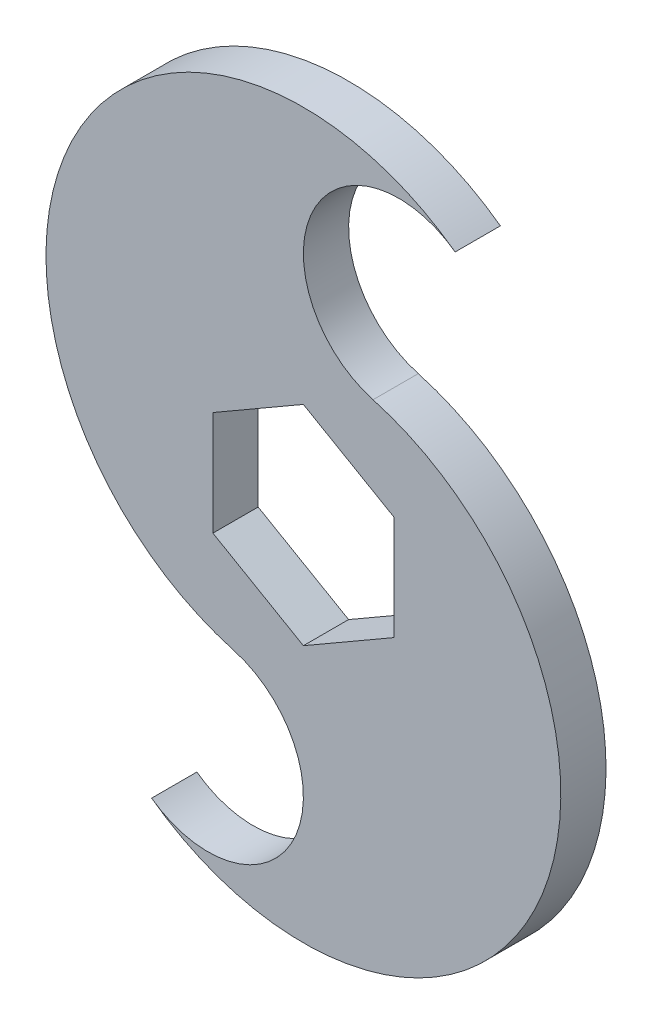
ISO-10303-21;
HEADER;
FILE_DESCRIPTION(('STEP AP214'),'2;1');
FILE_NAME('part.step','',(''),(''),'','','');
FILE_SCHEMA(('AUTOMOTIVE_DESIGN { 1 0 10303 214 1 1 1 1 }'));
ENDSEC;
DATA;
#1=APPLICATION_CONTEXT('core data for automotive mechanical design processes');
#2=APPLICATION_PROTOCOL_DEFINITION('international standard','automotive_design',2000,#1);
#3=PRODUCT_CONTEXT('',#1,'mechanical');
#4=PRODUCT('Part','Part','',(#3));
#5=PRODUCT_RELATED_PRODUCT_CATEGORY('part','',(#4));
#6=PRODUCT_DEFINITION_FORMATION('','',#4);
#7=PRODUCT_DEFINITION_CONTEXT('part definition',#1,'design');
#8=PRODUCT_DEFINITION('design','',#6,#7);
#9=PRODUCT_DEFINITION_SHAPE('','',#8);
#10=(LENGTH_UNIT() NAMED_UNIT(*) SI_UNIT(.MILLI.,.METRE.));
#11=(NAMED_UNIT(*) PLANE_ANGLE_UNIT() SI_UNIT($,.RADIAN.));
#12=(NAMED_UNIT(*) SI_UNIT($,.STERADIAN.) SOLID_ANGLE_UNIT());
#13=UNCERTAINTY_MEASURE_WITH_UNIT(LENGTH_MEASURE(1.E-05),#10,'distance_accuracy_value','');
#14=(GEOMETRIC_REPRESENTATION_CONTEXT(3) GLOBAL_UNCERTAINTY_ASSIGNED_CONTEXT((#13)) GLOBAL_UNIT_ASSIGNED_CONTEXT((#10,
#11,#12)) REPRESENTATION_CONTEXT('',''));
#15=CARTESIAN_POINT('',(0.,0.,0.));
#16=DIRECTION('',(0.,0.,1.));
#17=DIRECTION('',(1.,0.,0.));
#18=AXIS2_PLACEMENT_3D('',#15,#16,#17);
#19=CARTESIAN_POINT('',(6.70139784377673,9.18057683182266,3.175));
#20=DIRECTION('',(0.,0.,1.));
#21=DIRECTION('',(1.,0.,0.));
#22=AXIS2_PLACEMENT_3D('',#19,#20,#21);
#23=PLANE('',#22);
#24=CARTESIAN_POINT('',(13.4027956875535,33.0258505010618,3.175));
#25=DIRECTION('',(0.,0.,-1.));
#26=DIRECTION('',(1.,0.,0.));
#27=AXIS2_PLACEMENT_3D('',#24,#25,#26);
#28=CIRCLE('',#27,13.4027956875535);
#29=CARTESIAN_POINT('',(9.77659814642989,20.1229196853498,3.175));
#30=VERTEX_POINT('',#29);
#31=CARTESIAN_POINT('',(21.3049126203035,43.8513518854526,3.175));
#32=VERTEX_POINT('',#31);
#33=EDGE_CURVE('E161',#30,#32,#28,.T.);
#34=ORIENTED_EDGE('',*,*,#33,.T.);
#35=CARTESIAN_POINT('',(0.,14.6646968374165,3.175));
#36=DIRECTION('',(0.,0.,1.));
#37=DIRECTION('',(1.,0.,0.));
#38=AXIS2_PLACEMENT_3D('',#35,#36,#37);
#39=CIRCLE('',#38,36.1353031625835);
#40=CARTESIAN_POINT('',(-9.77659814642991,-20.1229196853498,3.175));
#41=VERTEX_POINT('',#40);
#42=EDGE_CURVE('E164',#32,#41,#39,.T.);
#43=ORIENTED_EDGE('',*,*,#42,.T.);
#44=CARTESIAN_POINT('',(-13.4027956875535,-33.0258505010618,3.175));
#45=DIRECTION('',(0.,0.,-1.));
#46=DIRECTION('',(-1.,0.,0.));
#47=AXIS2_PLACEMENT_3D('',#44,#45,#46);
#48=CIRCLE('',#47,13.4027956875534);
#49=CARTESIAN_POINT('',(-21.3049126203035,-43.8513518854526,3.175));
#50=VERTEX_POINT('',#49);
#51=EDGE_CURVE('E167',#41,#50,#48,.T.);
#52=ORIENTED_EDGE('',*,*,#51,.T.);
#53=CARTESIAN_POINT('',(0.,-14.6646968374165,3.175));
#54=DIRECTION('',(0.,0.,1.));
#55=DIRECTION('',(1.,0.,0.));
#56=AXIS2_PLACEMENT_3D('',#53,#54,#55);
#57=CIRCLE('',#56,36.1353031625835);
#58=EDGE_CURVE('E169',#50,#30,#57,.T.);
#59=ORIENTED_EDGE('',*,*,#58,.T.);
#60=EDGE_LOOP('',(#34,#43,#52,#59));
#61=FACE_BOUND('',#60,.T.);
#62=DIRECTION('',(-0.866025403784439,-0.499999999999999,0.));
#63=VECTOR('',#62,1.);
#64=CARTESIAN_POINT('',(0.,14.6646968374165,3.175));
#65=LINE('',#64,#63);
#66=CARTESIAN_POINT('',(0.,14.6646968374165,3.175));
#67=VERTEX_POINT('',#66);
#68=CARTESIAN_POINT('',(-12.7,7.33234841870826,3.175));
#69=VERTEX_POINT('',#68);
#70=EDGE_CURVE('E118',#67,#69,#65,.T.);
#71=ORIENTED_EDGE('',*,*,#70,.F.);
#72=DIRECTION('',(-0.866025403784439,0.5,0.));
#73=VECTOR('',#72,1.);
#74=CARTESIAN_POINT('',(12.7,7.33234841870824,3.175));
#75=LINE('',#74,#73);
#76=CARTESIAN_POINT('',(12.7,7.33234841870824,3.175));
#77=VERTEX_POINT('',#76);
#78=EDGE_CURVE('E110',#77,#67,#75,.T.);
#79=ORIENTED_EDGE('',*,*,#78,.F.);
#80=DIRECTION('',(0.,1.,0.));
#81=VECTOR('',#80,1.);
#82=CARTESIAN_POINT('',(12.7,-7.33234841870826,3.175));
#83=LINE('',#82,#81);
#84=CARTESIAN_POINT('',(12.7,-7.33234841870825,3.175));
#85=VERTEX_POINT('',#84);
#86=EDGE_CURVE('E139',#85,#77,#83,.T.);
#87=ORIENTED_EDGE('',*,*,#86,.F.);
#88=DIRECTION('',(0.866025403784439,0.5,0.));
#89=VECTOR('',#88,1.);
#90=CARTESIAN_POINT('',(0.,-14.6646968374165,3.175));
#91=LINE('',#90,#89);
#92=CARTESIAN_POINT('',(0.,-14.6646968374165,3.175));
#93=VERTEX_POINT('',#92);
#94=EDGE_CURVE('E137',#93,#85,#91,.T.);
#95=ORIENTED_EDGE('',*,*,#94,.F.);
#96=DIRECTION('',(0.866025403784439,-0.5,0.));
#97=VECTOR('',#96,1.);
#98=CARTESIAN_POINT('',(-12.7,-7.33234841870825,3.175));
#99=LINE('',#98,#97);
#100=CARTESIAN_POINT('',(-12.7,-7.33234841870825,3.175));
#101=VERTEX_POINT('',#100);
#102=EDGE_CURVE('E133',#101,#93,#99,.T.);
#103=ORIENTED_EDGE('',*,*,#102,.F.);
#104=DIRECTION('',(0.,-1.,0.));
#105=VECTOR('',#104,1.);
#106=CARTESIAN_POINT('',(-12.7,7.33234841870826,3.175));
#107=LINE('',#106,#105);
#108=EDGE_CURVE('E131',#69,#101,#107,.T.);
#109=ORIENTED_EDGE('',*,*,#108,.F.);
#110=EDGE_LOOP('',(#71,#79,#87,#95,#103,#109));
#111=FACE_BOUND('',#110,.T.);
#112=ADVANCED_FACE('F33',(#61,#111),#23,.T.);
#113=CARTESIAN_POINT('',(6.70139784377673,9.18057683182266,-3.175));
#114=DIRECTION('',(0.,0.,1.));
#115=DIRECTION('',(1.,0.,0.));
#116=AXIS2_PLACEMENT_3D('',#113,#114,#115);
#117=PLANE('',#116);
#118=CARTESIAN_POINT('',(13.4027956875535,33.0258505010618,-3.175));
#119=DIRECTION('',(0.,0.,-1.));
#120=DIRECTION('',(1.,0.,0.));
#121=AXIS2_PLACEMENT_3D('',#118,#119,#120);
#122=CIRCLE('',#121,13.4027956875535);
#123=CARTESIAN_POINT('',(9.77659814642989,20.1229196853498,-3.175));
#124=VERTEX_POINT('',#123);
#125=CARTESIAN_POINT('',(21.3049126203035,43.8513518854526,-3.175));
#126=VERTEX_POINT('',#125);
#127=EDGE_CURVE('E126',#124,#126,#122,.T.);
#128=ORIENTED_EDGE('',*,*,#127,.F.);
#129=CARTESIAN_POINT('',(0.,-14.6646968374165,-3.175));
#130=DIRECTION('',(0.,0.,1.));
#131=DIRECTION('',(1.,0.,0.));
#132=AXIS2_PLACEMENT_3D('',#129,#130,#131);
#133=CIRCLE('',#132,36.1353031625835);
#134=CARTESIAN_POINT('',(-21.3049126203035,-43.8513518854526,-3.175));
#135=VERTEX_POINT('',#134);
#136=EDGE_CURVE('E165',#135,#124,#133,.T.);
#137=ORIENTED_EDGE('',*,*,#136,.F.);
#138=CARTESIAN_POINT('',(-13.4027956875535,-33.0258505010618,-3.175));
#139=DIRECTION('',(0.,0.,-1.));
#140=DIRECTION('',(-1.,0.,0.));
#141=AXIS2_PLACEMENT_3D('',#138,#139,#140);
#142=CIRCLE('',#141,13.4027956875534);
#143=CARTESIAN_POINT('',(-9.77659814642991,-20.1229196853498,-3.175));
#144=VERTEX_POINT('',#143);
#145=EDGE_CURVE('E176',#144,#135,#142,.T.);
#146=ORIENTED_EDGE('',*,*,#145,.F.);
#147=CARTESIAN_POINT('',(0.,14.6646968374165,-3.175));
#148=DIRECTION('',(0.,0.,1.));
#149=DIRECTION('',(1.,0.,0.));
#150=AXIS2_PLACEMENT_3D('',#147,#148,#149);
#151=CIRCLE('',#150,36.1353031625835);
#152=EDGE_CURVE('E174',#126,#144,#151,.T.);
#153=ORIENTED_EDGE('',*,*,#152,.F.);
#154=EDGE_LOOP('',(#128,#137,#146,#153));
#155=FACE_BOUND('',#154,.T.);
#156=DIRECTION('',(-0.866025403784439,0.5,0.));
#157=VECTOR('',#156,1.);
#158=CARTESIAN_POINT('',(12.7,7.33234841870824,-3.175));
#159=LINE('',#158,#157);
#160=CARTESIAN_POINT('',(12.7,7.33234841870824,-3.175));
#161=VERTEX_POINT('',#160);
#162=CARTESIAN_POINT('',(0.,14.6646968374165,-3.175));
#163=VERTEX_POINT('',#162);
#164=EDGE_CURVE('E56',#161,#163,#159,.T.);
#165=ORIENTED_EDGE('',*,*,#164,.T.);
#166=DIRECTION('',(-0.866025403784439,-0.499999999999999,0.));
#167=VECTOR('',#166,1.);
#168=CARTESIAN_POINT('',(0.,14.6646968374165,-3.175));
#169=LINE('',#168,#167);
#170=CARTESIAN_POINT('',(-12.7,7.33234841870826,-3.175));
#171=VERTEX_POINT('',#170);
#172=EDGE_CURVE('E125',#163,#171,#169,.T.);
#173=ORIENTED_EDGE('',*,*,#172,.T.);
#174=DIRECTION('',(0.,-1.,0.));
#175=VECTOR('',#174,1.);
#176=CARTESIAN_POINT('',(-12.7,7.33234841870826,-3.175));
#177=LINE('',#176,#175);
#178=CARTESIAN_POINT('',(-12.7,-7.33234841870825,-3.175));
#179=VERTEX_POINT('',#178);
#180=EDGE_CURVE('E143',#171,#179,#177,.T.);
#181=ORIENTED_EDGE('',*,*,#180,.T.);
#182=DIRECTION('',(0.866025403784439,-0.5,0.));
#183=VECTOR('',#182,1.);
#184=CARTESIAN_POINT('',(-12.7,-7.33234841870825,-3.175));
#185=LINE('',#184,#183);
#186=CARTESIAN_POINT('',(0.,-14.6646968374165,-3.175));
#187=VERTEX_POINT('',#186);
#188=EDGE_CURVE('E146',#179,#187,#185,.T.);
#189=ORIENTED_EDGE('',*,*,#188,.T.);
#190=DIRECTION('',(0.866025403784439,0.5,0.));
#191=VECTOR('',#190,1.);
#192=CARTESIAN_POINT('',(0.,-14.6646968374165,-3.175));
#193=LINE('',#192,#191);
#194=CARTESIAN_POINT('',(12.7,-7.33234841870826,-3.175));
#195=VERTEX_POINT('',#194);
#196=EDGE_CURVE('E149',#187,#195,#193,.T.);
#197=ORIENTED_EDGE('',*,*,#196,.T.);
#198=DIRECTION('',(0.,1.,0.));
#199=VECTOR('',#198,1.);
#200=CARTESIAN_POINT('',(12.7,-7.33234841870826,-3.175));
#201=LINE('',#200,#199);
#202=EDGE_CURVE('E119',#195,#161,#201,.T.);
#203=ORIENTED_EDGE('',*,*,#202,.T.);
#204=EDGE_LOOP('',(#165,#173,#181,#189,#197,#203));
#205=FACE_BOUND('',#204,.T.);
#206=ADVANCED_FACE('F194',(#155,#205),#117,.F.);
#207=CARTESIAN_POINT('',(13.4027956875535,33.0258505010618,3.175));
#208=DIRECTION('',(0.,0.,-1.));
#209=DIRECTION('',(-1.,0.,0.));
#210=AXIS2_PLACEMENT_3D('',#207,#208,#209);
#211=CYLINDRICAL_SURFACE('',#210,13.4027956875535);
#212=ORIENTED_EDGE('',*,*,#127,.T.);
#213=DIRECTION('',(0.,0.,-1.));
#214=VECTOR('',#213,1.);
#215=CARTESIAN_POINT('',(21.3049126203035,43.8513518854526,3.175));
#216=LINE('',#215,#214);
#217=EDGE_CURVE('E11',#32,#126,#216,.T.);
#218=ORIENTED_EDGE('',*,*,#217,.F.);
#219=ORIENTED_EDGE('',*,*,#33,.F.);
#220=DIRECTION('',(0.,0.,-1.));
#221=VECTOR('',#220,1.);
#222=CARTESIAN_POINT('',(9.77659814642989,20.1229196853498,3.175));
#223=LINE('',#222,#221);
#224=EDGE_CURVE('E171',#30,#124,#223,.T.);
#225=ORIENTED_EDGE('',*,*,#224,.T.);
#226=EDGE_LOOP('',(#212,#218,#219,#225));
#227=FACE_BOUND('',#226,.T.);
#228=ADVANCED_FACE('F35',(#227),#211,.F.);
#229=CARTESIAN_POINT('',(0.,14.6646968374165,3.175));
#230=DIRECTION('',(0.,0.,-1.));
#231=DIRECTION('',(-1.,0.,0.));
#232=AXIS2_PLACEMENT_3D('',#229,#230,#231);
#233=CYLINDRICAL_SURFACE('',#232,36.1353031625835);
#234=ORIENTED_EDGE('',*,*,#152,.T.);
#235=DIRECTION('',(0.,0.,-1.));
#236=VECTOR('',#235,1.);
#237=CARTESIAN_POINT('',(-9.77659814642991,-20.1229196853498,3.175));
#238=LINE('',#237,#236);
#239=EDGE_CURVE('E41',#41,#144,#238,.T.);
#240=ORIENTED_EDGE('',*,*,#239,.F.);
#241=ORIENTED_EDGE('',*,*,#42,.F.);
#242=ORIENTED_EDGE('',*,*,#217,.T.);
#243=EDGE_LOOP('',(#234,#240,#241,#242));
#244=FACE_BOUND('',#243,.T.);
#245=ADVANCED_FACE('F204',(#244),#233,.T.);
#246=CARTESIAN_POINT('',(-13.4027956875535,-33.0258505010618,3.175));
#247=DIRECTION('',(0.,0.,-1.));
#248=DIRECTION('',(-1.,0.,0.));
#249=AXIS2_PLACEMENT_3D('',#246,#247,#248);
#250=CYLINDRICAL_SURFACE('',#249,13.4027956875534);
#251=ORIENTED_EDGE('',*,*,#145,.T.);
#252=DIRECTION('',(0.,0.,-1.));
#253=VECTOR('',#252,1.);
#254=CARTESIAN_POINT('',(-21.3049126203035,-43.8513518854526,3.175));
#255=LINE('',#254,#253);
#256=EDGE_CURVE('E181',#50,#135,#255,.T.);
#257=ORIENTED_EDGE('',*,*,#256,.F.);
#258=ORIENTED_EDGE('',*,*,#51,.F.);
#259=ORIENTED_EDGE('',*,*,#239,.T.);
#260=EDGE_LOOP('',(#251,#257,#258,#259));
#261=FACE_BOUND('',#260,.T.);
#262=ADVANCED_FACE('F188',(#261),#250,.F.);
#263=CARTESIAN_POINT('',(0.,-14.6646968374165,3.175));
#264=DIRECTION('',(0.,0.,-1.));
#265=DIRECTION('',(-1.,0.,0.));
#266=AXIS2_PLACEMENT_3D('',#263,#264,#265);
#267=CYLINDRICAL_SURFACE('',#266,36.1353031625835);
#268=ORIENTED_EDGE('',*,*,#136,.T.);
#269=ORIENTED_EDGE('',*,*,#224,.F.);
#270=ORIENTED_EDGE('',*,*,#58,.F.);
#271=ORIENTED_EDGE('',*,*,#256,.T.);
#272=EDGE_LOOP('',(#268,#269,#270,#271));
#273=FACE_BOUND('',#272,.T.);
#274=ADVANCED_FACE('F198',(#273),#267,.T.);
#275=CARTESIAN_POINT('',(12.7,7.33234841870824,3.175));
#276=DIRECTION('',(-0.5,-0.866025403784439,0.));
#277=DIRECTION('',(0.866025403784439,-0.5,0.));
#278=AXIS2_PLACEMENT_3D('',#275,#276,#277);
#279=PLANE('',#278);
#280=ORIENTED_EDGE('',*,*,#164,.F.);
#281=DIRECTION('',(0.,0.,-1.));
#282=VECTOR('',#281,1.);
#283=CARTESIAN_POINT('',(12.7,7.33234841870824,3.175));
#284=LINE('',#283,#282);
#285=EDGE_CURVE('E114',#77,#161,#284,.T.);
#286=ORIENTED_EDGE('',*,*,#285,.F.);
#287=ORIENTED_EDGE('',*,*,#78,.T.);
#288=DIRECTION('',(0.,0.,-1.));
#289=VECTOR('',#288,1.);
#290=CARTESIAN_POINT('',(0.,14.6646968374165,3.175));
#291=LINE('',#290,#289);
#292=EDGE_CURVE('E113',#67,#163,#291,.T.);
#293=ORIENTED_EDGE('',*,*,#292,.T.);
#294=EDGE_LOOP('',(#280,#286,#287,#293));
#295=FACE_BOUND('',#294,.T.);
#296=ADVANCED_FACE('F112',(#295),#279,.T.);
#297=CARTESIAN_POINT('',(0.,14.6646968374165,3.175));
#298=DIRECTION('',(0.499999999999999,-0.866025403784439,0.));
#299=DIRECTION('',(0.866025403784439,0.5,0.));
#300=AXIS2_PLACEMENT_3D('',#297,#298,#299);
#301=PLANE('',#300);
#302=ORIENTED_EDGE('',*,*,#172,.F.);
#303=ORIENTED_EDGE('',*,*,#292,.F.);
#304=ORIENTED_EDGE('',*,*,#70,.T.);
#305=DIRECTION('',(0.,0.,-1.));
#306=VECTOR('',#305,1.);
#307=CARTESIAN_POINT('',(-12.7,7.33234841870826,3.175));
#308=LINE('',#307,#306);
#309=EDGE_CURVE('E127',#69,#171,#308,.T.);
#310=ORIENTED_EDGE('',*,*,#309,.T.);
#311=EDGE_LOOP('',(#302,#303,#304,#310));
#312=FACE_BOUND('',#311,.T.);
#313=ADVANCED_FACE('F122',(#312),#301,.T.);
#314=CARTESIAN_POINT('',(-12.7,7.33234841870826,3.175));
#315=DIRECTION('',(1.,0.,0.));
#316=DIRECTION('',(0.,1.,0.));
#317=AXIS2_PLACEMENT_3D('',#314,#315,#316);
#318=PLANE('',#317);
#319=ORIENTED_EDGE('',*,*,#180,.F.);
#320=ORIENTED_EDGE('',*,*,#309,.F.);
#321=ORIENTED_EDGE('',*,*,#108,.T.);
#322=DIRECTION('',(0.,0.,-1.));
#323=VECTOR('',#322,1.);
#324=CARTESIAN_POINT('',(-12.7,-7.33234841870825,3.175));
#325=LINE('',#324,#323);
#326=EDGE_CURVE('E158',#101,#179,#325,.T.);
#327=ORIENTED_EDGE('',*,*,#326,.T.);
#328=EDGE_LOOP('',(#319,#320,#321,#327));
#329=FACE_BOUND('',#328,.T.);
#330=ADVANCED_FACE('F227',(#329),#318,.T.);
#331=CARTESIAN_POINT('',(-12.7,-7.33234841870825,3.175));
#332=DIRECTION('',(0.5,0.866025403784439,0.));
#333=DIRECTION('',(-0.866025403784439,0.5,0.));
#334=AXIS2_PLACEMENT_3D('',#331,#332,#333);
#335=PLANE('',#334);
#336=ORIENTED_EDGE('',*,*,#188,.F.);
#337=ORIENTED_EDGE('',*,*,#326,.F.);
#338=ORIENTED_EDGE('',*,*,#102,.T.);
#339=DIRECTION('',(0.,0.,-1.));
#340=VECTOR('',#339,1.);
#341=CARTESIAN_POINT('',(0.,-14.6646968374165,3.175));
#342=LINE('',#341,#340);
#343=EDGE_CURVE('E156',#93,#187,#342,.T.);
#344=ORIENTED_EDGE('',*,*,#343,.T.);
#345=EDGE_LOOP('',(#336,#337,#338,#344));
#346=FACE_BOUND('',#345,.T.);
#347=ADVANCED_FACE('F231',(#346),#335,.T.);
#348=CARTESIAN_POINT('',(0.,-14.6646968374165,3.175));
#349=DIRECTION('',(-0.5,0.866025403784439,0.));
#350=DIRECTION('',(-0.866025403784439,-0.5,0.));
#351=AXIS2_PLACEMENT_3D('',#348,#349,#350);
#352=PLANE('',#351);
#353=ORIENTED_EDGE('',*,*,#196,.F.);
#354=ORIENTED_EDGE('',*,*,#343,.F.);
#355=ORIENTED_EDGE('',*,*,#94,.T.);
#356=DIRECTION('',(0.,0.,-1.));
#357=VECTOR('',#356,1.);
#358=CARTESIAN_POINT('',(12.7,-7.33234841870826,3.175));
#359=LINE('',#358,#357);
#360=EDGE_CURVE('E48',#85,#195,#359,.T.);
#361=ORIENTED_EDGE('',*,*,#360,.T.);
#362=EDGE_LOOP('',(#353,#354,#355,#361));
#363=FACE_BOUND('',#362,.T.);
#364=ADVANCED_FACE('F237',(#363),#352,.T.);
#365=CARTESIAN_POINT('',(12.7,-7.33234841870826,3.175));
#366=DIRECTION('',(-1.,0.,0.));
#367=DIRECTION('',(0.,0.,1.));
#368=AXIS2_PLACEMENT_3D('',#365,#366,#367);
#369=PLANE('',#368);
#370=ORIENTED_EDGE('',*,*,#202,.F.);
#371=ORIENTED_EDGE('',*,*,#360,.F.);
#372=ORIENTED_EDGE('',*,*,#86,.T.);
#373=ORIENTED_EDGE('',*,*,#285,.T.);
#374=EDGE_LOOP('',(#370,#371,#372,#373));
#375=FACE_BOUND('',#374,.T.);
#376=ADVANCED_FACE('F241',(#375),#369,.T.);
#377=CLOSED_SHELL('',(#112,#206,#228,#245,#262,#274,#296,#313,#330,#347,#364,#376));
#378=MANIFOLD_SOLID_BREP('B2',#377);
#379=ADVANCED_BREP_SHAPE_REPRESENTATION('',(#18,#378),#14);
#380=SHAPE_DEFINITION_REPRESENTATION(#9,#379);
ENDSEC;
END-ISO-10303-21;
